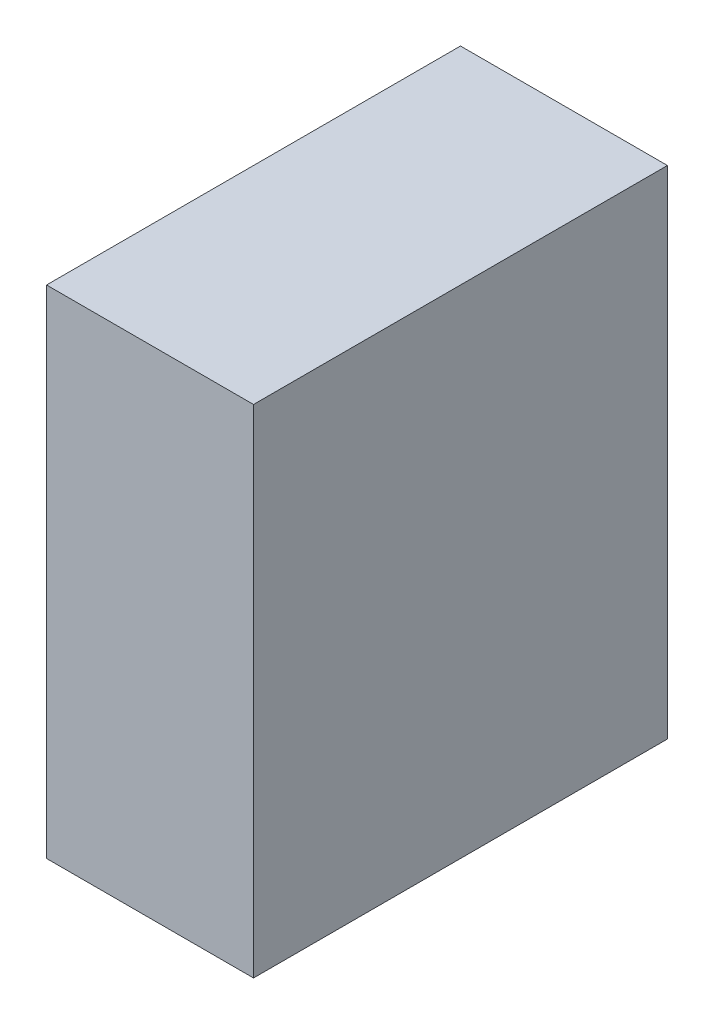
ISO-10303-21;
HEADER;
FILE_DESCRIPTION(('STEP AP214'),'2;1');
FILE_NAME('part.step','',(''),(''),'','','');
FILE_SCHEMA(('AUTOMOTIVE_DESIGN { 1 0 10303 214 1 1 1 1 }'));
ENDSEC;
DATA;
#1=APPLICATION_CONTEXT('core data for automotive mechanical design processes');
#2=APPLICATION_PROTOCOL_DEFINITION('international standard','automotive_design',2000,#1);
#3=PRODUCT_CONTEXT('',#1,'mechanical');
#4=PRODUCT('Part','Part','',(#3));
#5=PRODUCT_RELATED_PRODUCT_CATEGORY('part','',(#4));
#6=PRODUCT_DEFINITION_FORMATION('','',#4);
#7=PRODUCT_DEFINITION_CONTEXT('part definition',#1,'design');
#8=PRODUCT_DEFINITION('design','',#6,#7);
#9=PRODUCT_DEFINITION_SHAPE('','',#8);
#10=(LENGTH_UNIT() NAMED_UNIT(*) SI_UNIT(.MILLI.,.METRE.));
#11=(NAMED_UNIT(*) PLANE_ANGLE_UNIT() SI_UNIT($,.RADIAN.));
#12=(NAMED_UNIT(*) SI_UNIT($,.STERADIAN.) SOLID_ANGLE_UNIT());
#13=UNCERTAINTY_MEASURE_WITH_UNIT(LENGTH_MEASURE(1.E-05),#10,'distance_accuracy_value','');
#14=(GEOMETRIC_REPRESENTATION_CONTEXT(3) GLOBAL_UNCERTAINTY_ASSIGNED_CONTEXT((#13)) GLOBAL_UNIT_ASSIGNED_CONTEXT((#10,
#11,#12)) REPRESENTATION_CONTEXT('',''));
#15=CARTESIAN_POINT('',(0.,0.,0.));
#16=DIRECTION('',(0.,0.,1.));
#17=DIRECTION('',(1.,0.,0.));
#18=AXIS2_PLACEMENT_3D('',#15,#16,#17);
#19=CARTESIAN_POINT('',(3.175,4.40972222222223,3.70416666666667));
#20=DIRECTION('',(0.,-1.,0.));
#21=DIRECTION('',(0.,0.,-1.));
#22=AXIS2_PLACEMENT_3D('',#19,#20,#21);
#23=PLANE('',#22);
#24=DIRECTION('',(0.,0.,1.));
#25=VECTOR('',#24,1.);
#26=CARTESIAN_POINT('',(0.,4.40972222222223,3.70416666666667));
#27=LINE('',#26,#25);
#28=CARTESIAN_POINT('',(0.,4.40972222222223,3.70416666666667));
#29=VERTEX_POINT('',#28);
#30=CARTESIAN_POINT('',(0.,4.40972222222223,10.0541666666667));
#31=VERTEX_POINT('',#30);
#32=EDGE_CURVE('E96',#29,#31,#27,.T.);
#33=ORIENTED_EDGE('',*,*,#32,.T.);
#34=DIRECTION('',(-1.,0.,0.));
#35=VECTOR('',#34,1.);
#36=CARTESIAN_POINT('',(3.175,4.40972222222223,10.0541666666667));
#37=LINE('',#36,#35);
#38=CARTESIAN_POINT('',(3.175,4.40972222222223,10.0541666666667));
#39=VERTEX_POINT('',#38);
#40=EDGE_CURVE('E11',#39,#31,#37,.T.);
#41=ORIENTED_EDGE('',*,*,#40,.F.);
#42=DIRECTION('',(0.,0.,1.));
#43=VECTOR('',#42,1.);
#44=CARTESIAN_POINT('',(3.175,4.40972222222223,3.70416666666667));
#45=LINE('',#44,#43);
#46=CARTESIAN_POINT('',(3.175,4.40972222222223,3.70416666666667));
#47=VERTEX_POINT('',#46);
#48=EDGE_CURVE('E84',#47,#39,#45,.T.);
#49=ORIENTED_EDGE('',*,*,#48,.F.);
#50=DIRECTION('',(-1.,0.,0.));
#51=VECTOR('',#50,1.);
#52=CARTESIAN_POINT('',(3.175,4.40972222222223,3.70416666666667));
#53=LINE('',#52,#51);
#54=EDGE_CURVE('E92',#47,#29,#53,.T.);
#55=ORIENTED_EDGE('',*,*,#54,.T.);
#56=EDGE_LOOP('',(#33,#41,#49,#55));
#57=FACE_BOUND('',#56,.T.);
#58=ADVANCED_FACE('F33',(#57),#23,.F.);
#59=CARTESIAN_POINT('',(3.175,4.40972222222223,10.0541666666667));
#60=DIRECTION('',(0.,0.,-1.));
#61=DIRECTION('',(0.,1.,0.));
#62=AXIS2_PLACEMENT_3D('',#59,#60,#61);
#63=PLANE('',#62);
#64=DIRECTION('',(0.,-1.,0.));
#65=VECTOR('',#64,1.);
#66=CARTESIAN_POINT('',(0.,4.40972222222223,10.0541666666667));
#67=LINE('',#66,#65);
#68=CARTESIAN_POINT('',(0.,-3.21027777777777,10.0541666666667));
#69=VERTEX_POINT('',#68);
#70=EDGE_CURVE('E88',#31,#69,#67,.T.);
#71=ORIENTED_EDGE('',*,*,#70,.T.);
#72=DIRECTION('',(-1.,0.,0.));
#73=VECTOR('',#72,1.);
#74=CARTESIAN_POINT('',(3.175,-3.21027777777777,10.0541666666667));
#75=LINE('',#74,#73);
#76=CARTESIAN_POINT('',(3.175,-3.21027777777777,10.0541666666667));
#77=VERTEX_POINT('',#76);
#78=EDGE_CURVE('E41',#77,#69,#75,.T.);
#79=ORIENTED_EDGE('',*,*,#78,.F.);
#80=DIRECTION('',(0.,-1.,0.));
#81=VECTOR('',#80,1.);
#82=CARTESIAN_POINT('',(3.175,4.40972222222223,10.0541666666667));
#83=LINE('',#82,#81);
#84=EDGE_CURVE('E79',#39,#77,#83,.T.);
#85=ORIENTED_EDGE('',*,*,#84,.F.);
#86=ORIENTED_EDGE('',*,*,#40,.T.);
#87=EDGE_LOOP('',(#71,#79,#85,#86));
#88=FACE_BOUND('',#87,.T.);
#89=ADVANCED_FACE('F87',(#88),#63,.F.);
#90=CARTESIAN_POINT('',(3.175,-3.21027777777777,10.0541666666667));
#91=DIRECTION('',(0.,1.,0.));
#92=DIRECTION('',(0.,0.,1.));
#93=AXIS2_PLACEMENT_3D('',#90,#91,#92);
#94=PLANE('',#93);
#95=DIRECTION('',(0.,0.,-1.));
#96=VECTOR('',#95,1.);
#97=CARTESIAN_POINT('',(0.,-3.21027777777777,10.0541666666667));
#98=LINE('',#97,#96);
#99=CARTESIAN_POINT('',(0.,-3.21027777777777,3.70416666666667));
#100=VERTEX_POINT('',#99);
#101=EDGE_CURVE('E66',#69,#100,#98,.T.);
#102=ORIENTED_EDGE('',*,*,#101,.T.);
#103=DIRECTION('',(-1.,0.,0.));
#104=VECTOR('',#103,1.);
#105=CARTESIAN_POINT('',(3.175,-3.21027777777777,3.70416666666667));
#106=LINE('',#105,#104);
#107=CARTESIAN_POINT('',(3.175,-3.21027777777777,3.70416666666667));
#108=VERTEX_POINT('',#107);
#109=EDGE_CURVE('E89',#108,#100,#106,.T.);
#110=ORIENTED_EDGE('',*,*,#109,.F.);
#111=DIRECTION('',(0.,0.,-1.));
#112=VECTOR('',#111,1.);
#113=CARTESIAN_POINT('',(3.175,-3.21027777777777,10.0541666666667));
#114=LINE('',#113,#112);
#115=EDGE_CURVE('E82',#77,#108,#114,.T.);
#116=ORIENTED_EDGE('',*,*,#115,.F.);
#117=ORIENTED_EDGE('',*,*,#78,.T.);
#118=EDGE_LOOP('',(#102,#110,#116,#117));
#119=FACE_BOUND('',#118,.T.);
#120=ADVANCED_FACE('F90',(#119),#94,.F.);
#121=CARTESIAN_POINT('',(3.175,-3.21027777777777,3.70416666666667));
#122=DIRECTION('',(0.,0.,1.));
#123=DIRECTION('',(1.,0.,0.));
#124=AXIS2_PLACEMENT_3D('',#121,#122,#123);
#125=PLANE('',#124);
#126=DIRECTION('',(0.,1.,0.));
#127=VECTOR('',#126,1.);
#128=CARTESIAN_POINT('',(0.,-3.21027777777777,3.70416666666667));
#129=LINE('',#128,#127);
#130=EDGE_CURVE('E72',#100,#29,#129,.T.);
#131=ORIENTED_EDGE('',*,*,#130,.T.);
#132=ORIENTED_EDGE('',*,*,#54,.F.);
#133=DIRECTION('',(0.,1.,0.));
#134=VECTOR('',#133,1.);
#135=CARTESIAN_POINT('',(3.175,-3.21027777777777,3.70416666666667));
#136=LINE('',#135,#134);
#137=EDGE_CURVE('E49',#108,#47,#136,.T.);
#138=ORIENTED_EDGE('',*,*,#137,.F.);
#139=ORIENTED_EDGE('',*,*,#109,.T.);
#140=EDGE_LOOP('',(#131,#132,#138,#139));
#141=FACE_BOUND('',#140,.T.);
#142=ADVANCED_FACE('F103',(#141),#125,.F.);
#143=CARTESIAN_POINT('',(3.175,0.,0.));
#144=DIRECTION('',(1.,0.,0.));
#145=DIRECTION('',(0.,0.,-1.));
#146=AXIS2_PLACEMENT_3D('',#143,#144,#145);
#147=PLANE('',#146);
#148=ORIENTED_EDGE('',*,*,#48,.T.);
#149=ORIENTED_EDGE('',*,*,#84,.T.);
#150=ORIENTED_EDGE('',*,*,#115,.T.);
#151=ORIENTED_EDGE('',*,*,#137,.T.);
#152=EDGE_LOOP('',(#148,#149,#150,#151));
#153=FACE_BOUND('',#152,.T.);
#154=ADVANCED_FACE('F80',(#153),#147,.T.);
#155=CARTESIAN_POINT('',(0.,0.,0.));
#156=DIRECTION('',(1.,0.,0.));
#157=DIRECTION('',(0.,0.,-1.));
#158=AXIS2_PLACEMENT_3D('',#155,#156,#157);
#159=PLANE('',#158);
#160=ORIENTED_EDGE('',*,*,#32,.F.);
#161=ORIENTED_EDGE('',*,*,#130,.F.);
#162=ORIENTED_EDGE('',*,*,#101,.F.);
#163=ORIENTED_EDGE('',*,*,#70,.F.);
#164=EDGE_LOOP('',(#160,#161,#162,#163));
#165=FACE_BOUND('',#164,.T.);
#166=ADVANCED_FACE('F106',(#165),#159,.F.);
#167=CLOSED_SHELL('',(#58,#89,#120,#142,#154,#166));
#168=MANIFOLD_SOLID_BREP('B2',#167);
#169=ADVANCED_BREP_SHAPE_REPRESENTATION('',(#18,#168),#14);
#170=SHAPE_DEFINITION_REPRESENTATION(#9,#169);
ENDSEC;
END-ISO-10303-21;
